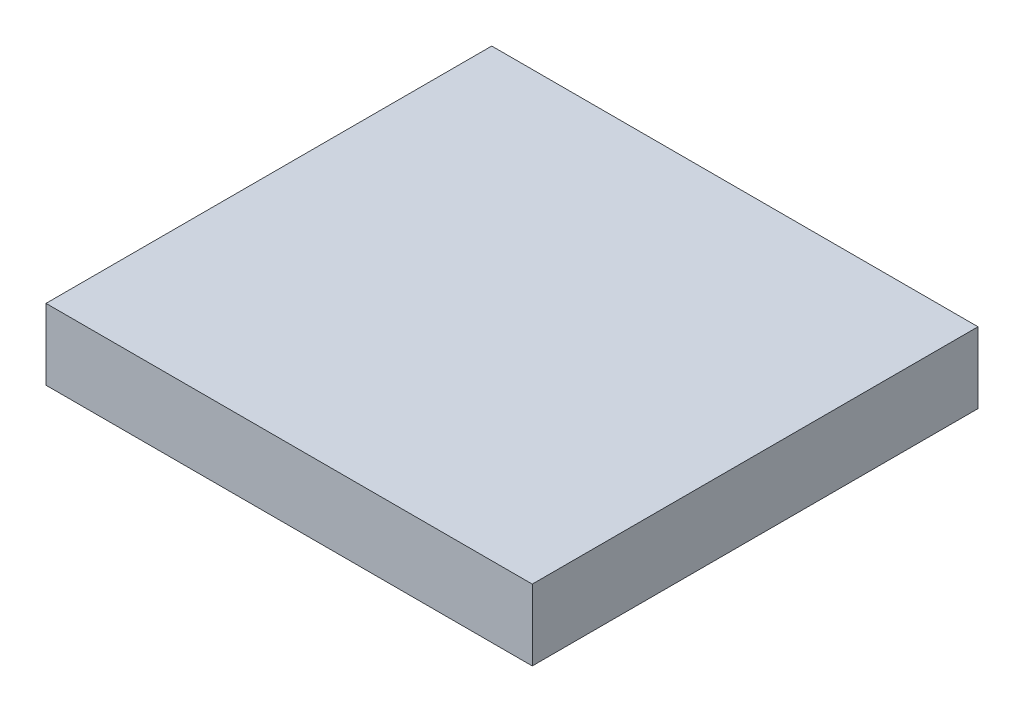
ISO-10303-21;
HEADER;
FILE_DESCRIPTION(('STEP AP214'),'2;1');
FILE_NAME('part.step','',(''),(''),'','','');
FILE_SCHEMA(('AUTOMOTIVE_DESIGN { 1 0 10303 214 1 1 1 1 }'));
ENDSEC;
DATA;
#1=APPLICATION_CONTEXT('core data for automotive mechanical design processes');
#2=APPLICATION_PROTOCOL_DEFINITION('international standard','automotive_design',2000,#1);
#3=PRODUCT_CONTEXT('',#1,'mechanical');
#4=PRODUCT('Part','Part','',(#3));
#5=PRODUCT_RELATED_PRODUCT_CATEGORY('part','',(#4));
#6=PRODUCT_DEFINITION_FORMATION('','',#4);
#7=PRODUCT_DEFINITION_CONTEXT('part definition',#1,'design');
#8=PRODUCT_DEFINITION('design','',#6,#7);
#9=PRODUCT_DEFINITION_SHAPE('','',#8);
#10=(LENGTH_UNIT() NAMED_UNIT(*) SI_UNIT(.MILLI.,.METRE.));
#11=(NAMED_UNIT(*) PLANE_ANGLE_UNIT() SI_UNIT($,.RADIAN.));
#12=(NAMED_UNIT(*) SI_UNIT($,.STERADIAN.) SOLID_ANGLE_UNIT());
#13=UNCERTAINTY_MEASURE_WITH_UNIT(LENGTH_MEASURE(1.E-05),#10,'distance_accuracy_value','');
#14=(GEOMETRIC_REPRESENTATION_CONTEXT(3) GLOBAL_UNCERTAINTY_ASSIGNED_CONTEXT((#13)) GLOBAL_UNIT_ASSIGNED_CONTEXT((#10,
#11,#12)) REPRESENTATION_CONTEXT('',''));
#15=CARTESIAN_POINT('',(0.,0.,0.));
#16=DIRECTION('',(0.,0.,1.));
#17=DIRECTION('',(1.,0.,0.));
#18=AXIS2_PLACEMENT_3D('',#15,#16,#17);
#19=CARTESIAN_POINT('',(0.,44.45,0.));
#20=DIRECTION('',(1.,0.,0.));
#21=DIRECTION('',(0.,0.,-1.));
#22=AXIS2_PLACEMENT_3D('',#19,#20,#21);
#23=PLANE('',#22);
#24=DIRECTION('',(0.,0.,1.));
#25=VECTOR('',#24,1.);
#26=CARTESIAN_POINT('',(0.,0.,0.));
#27=LINE('',#26,#25);
#28=CARTESIAN_POINT('',(0.,0.,-279.4));
#29=VERTEX_POINT('',#28);
#30=CARTESIAN_POINT('',(0.,0.,0.));
#31=VERTEX_POINT('',#30);
#32=EDGE_CURVE('E96',#29,#31,#27,.T.);
#33=ORIENTED_EDGE('',*,*,#32,.T.);
#34=DIRECTION('',(0.,-1.,0.));
#35=VECTOR('',#34,1.);
#36=CARTESIAN_POINT('',(0.,44.45,0.));
#37=LINE('',#36,#35);
#38=CARTESIAN_POINT('',(0.,44.45,0.));
#39=VERTEX_POINT('',#38);
#40=EDGE_CURVE('E11',#39,#31,#37,.T.);
#41=ORIENTED_EDGE('',*,*,#40,.F.);
#42=DIRECTION('',(0.,0.,1.));
#43=VECTOR('',#42,1.);
#44=CARTESIAN_POINT('',(0.,44.45,0.));
#45=LINE('',#44,#43);
#46=CARTESIAN_POINT('',(0.,44.45,-279.4));
#47=VERTEX_POINT('',#46);
#48=EDGE_CURVE('E84',#47,#39,#45,.T.);
#49=ORIENTED_EDGE('',*,*,#48,.F.);
#50=DIRECTION('',(0.,-1.,0.));
#51=VECTOR('',#50,1.);
#52=CARTESIAN_POINT('',(0.,44.45,-279.4));
#53=LINE('',#52,#51);
#54=EDGE_CURVE('E92',#47,#29,#53,.T.);
#55=ORIENTED_EDGE('',*,*,#54,.T.);
#56=EDGE_LOOP('',(#33,#41,#49,#55));
#57=FACE_BOUND('',#56,.T.);
#58=ADVANCED_FACE('F33',(#57),#23,.F.);
#59=CARTESIAN_POINT('',(0.,44.45,0.));
#60=DIRECTION('',(0.,0.,-1.));
#61=DIRECTION('',(-1.,0.,0.));
#62=AXIS2_PLACEMENT_3D('',#59,#60,#61);
#63=PLANE('',#62);
#64=DIRECTION('',(1.,0.,0.));
#65=VECTOR('',#64,1.);
#66=CARTESIAN_POINT('',(0.,0.,0.));
#67=LINE('',#66,#65);
#68=CARTESIAN_POINT('',(304.8,0.,0.));
#69=VERTEX_POINT('',#68);
#70=EDGE_CURVE('E88',#31,#69,#67,.T.);
#71=ORIENTED_EDGE('',*,*,#70,.T.);
#72=DIRECTION('',(0.,-1.,0.));
#73=VECTOR('',#72,1.);
#74=CARTESIAN_POINT('',(304.8,44.45,0.));
#75=LINE('',#74,#73);
#76=CARTESIAN_POINT('',(304.8,44.45,0.));
#77=VERTEX_POINT('',#76);
#78=EDGE_CURVE('E41',#77,#69,#75,.T.);
#79=ORIENTED_EDGE('',*,*,#78,.F.);
#80=DIRECTION('',(1.,0.,0.));
#81=VECTOR('',#80,1.);
#82=CARTESIAN_POINT('',(0.,44.45,0.));
#83=LINE('',#82,#81);
#84=EDGE_CURVE('E79',#39,#77,#83,.T.);
#85=ORIENTED_EDGE('',*,*,#84,.F.);
#86=ORIENTED_EDGE('',*,*,#40,.T.);
#87=EDGE_LOOP('',(#71,#79,#85,#86));
#88=FACE_BOUND('',#87,.T.);
#89=ADVANCED_FACE('F87',(#88),#63,.F.);
#90=CARTESIAN_POINT('',(304.8,44.45,0.));
#91=DIRECTION('',(-1.,0.,0.));
#92=DIRECTION('',(0.,0.,1.));
#93=AXIS2_PLACEMENT_3D('',#90,#91,#92);
#94=PLANE('',#93);
#95=DIRECTION('',(0.,0.,-1.));
#96=VECTOR('',#95,1.);
#97=CARTESIAN_POINT('',(304.8,0.,0.));
#98=LINE('',#97,#96);
#99=CARTESIAN_POINT('',(304.8,0.,-279.4));
#100=VERTEX_POINT('',#99);
#101=EDGE_CURVE('E66',#69,#100,#98,.T.);
#102=ORIENTED_EDGE('',*,*,#101,.T.);
#103=DIRECTION('',(0.,-1.,0.));
#104=VECTOR('',#103,1.);
#105=CARTESIAN_POINT('',(304.8,44.45,-279.4));
#106=LINE('',#105,#104);
#107=CARTESIAN_POINT('',(304.8,44.45,-279.4));
#108=VERTEX_POINT('',#107);
#109=EDGE_CURVE('E89',#108,#100,#106,.T.);
#110=ORIENTED_EDGE('',*,*,#109,.F.);
#111=DIRECTION('',(0.,0.,-1.));
#112=VECTOR('',#111,1.);
#113=CARTESIAN_POINT('',(304.8,44.45,0.));
#114=LINE('',#113,#112);
#115=EDGE_CURVE('E82',#77,#108,#114,.T.);
#116=ORIENTED_EDGE('',*,*,#115,.F.);
#117=ORIENTED_EDGE('',*,*,#78,.T.);
#118=EDGE_LOOP('',(#102,#110,#116,#117));
#119=FACE_BOUND('',#118,.T.);
#120=ADVANCED_FACE('F90',(#119),#94,.F.);
#121=CARTESIAN_POINT('',(0.,44.45,-279.4));
#122=DIRECTION('',(0.,0.,1.));
#123=DIRECTION('',(1.,0.,0.));
#124=AXIS2_PLACEMENT_3D('',#121,#122,#123);
#125=PLANE('',#124);
#126=DIRECTION('',(-1.,0.,0.));
#127=VECTOR('',#126,1.);
#128=CARTESIAN_POINT('',(0.,0.,-279.4));
#129=LINE('',#128,#127);
#130=EDGE_CURVE('E72',#100,#29,#129,.T.);
#131=ORIENTED_EDGE('',*,*,#130,.T.);
#132=ORIENTED_EDGE('',*,*,#54,.F.);
#133=DIRECTION('',(-1.,0.,0.));
#134=VECTOR('',#133,1.);
#135=CARTESIAN_POINT('',(0.,44.45,-279.4));
#136=LINE('',#135,#134);
#137=EDGE_CURVE('E49',#108,#47,#136,.T.);
#138=ORIENTED_EDGE('',*,*,#137,.F.);
#139=ORIENTED_EDGE('',*,*,#109,.T.);
#140=EDGE_LOOP('',(#131,#132,#138,#139));
#141=FACE_BOUND('',#140,.T.);
#142=ADVANCED_FACE('F103',(#141),#125,.F.);
#143=CARTESIAN_POINT('',(0.,44.45,0.));
#144=DIRECTION('',(0.,-1.,0.));
#145=DIRECTION('',(0.,0.,-1.));
#146=AXIS2_PLACEMENT_3D('',#143,#144,#145);
#147=PLANE('',#146);
#148=ORIENTED_EDGE('',*,*,#48,.T.);
#149=ORIENTED_EDGE('',*,*,#84,.T.);
#150=ORIENTED_EDGE('',*,*,#115,.T.);
#151=ORIENTED_EDGE('',*,*,#137,.T.);
#152=EDGE_LOOP('',(#148,#149,#150,#151));
#153=FACE_BOUND('',#152,.T.);
#154=ADVANCED_FACE('F80',(#153),#147,.F.);
#155=CARTESIAN_POINT('',(0.,0.,0.));
#156=DIRECTION('',(0.,-1.,0.));
#157=DIRECTION('',(0.,0.,-1.));
#158=AXIS2_PLACEMENT_3D('',#155,#156,#157);
#159=PLANE('',#158);
#160=ORIENTED_EDGE('',*,*,#32,.F.);
#161=ORIENTED_EDGE('',*,*,#130,.F.);
#162=ORIENTED_EDGE('',*,*,#101,.F.);
#163=ORIENTED_EDGE('',*,*,#70,.F.);
#164=EDGE_LOOP('',(#160,#161,#162,#163));
#165=FACE_BOUND('',#164,.T.);
#166=ADVANCED_FACE('F106',(#165),#159,.T.);
#167=CLOSED_SHELL('',(#58,#89,#120,#142,#154,#166));
#168=MANIFOLD_SOLID_BREP('B2',#167);
#169=ADVANCED_BREP_SHAPE_REPRESENTATION('',(#18,#168),#14);
#170=SHAPE_DEFINITION_REPRESENTATION(#9,#169);
ENDSEC;
END-ISO-10303-21;
